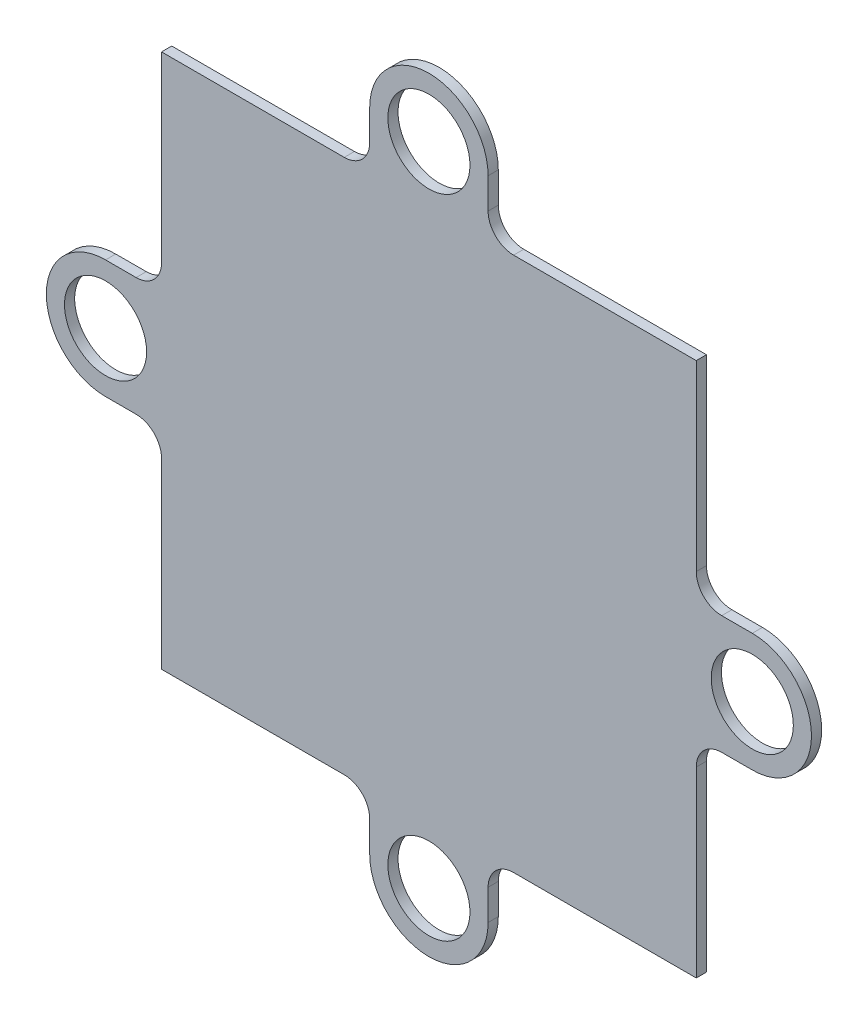
ISO-10303-21;
HEADER;
FILE_DESCRIPTION(('STEP AP214'),'2;1');
FILE_NAME('part.step','',(''),(''),'','','');
FILE_SCHEMA(('AUTOMOTIVE_DESIGN { 1 0 10303 214 1 1 1 1 }'));
ENDSEC;
DATA;
#1=APPLICATION_CONTEXT('core data for automotive mechanical design processes');
#2=APPLICATION_PROTOCOL_DEFINITION('international standard','automotive_design',2000,#1);
#3=PRODUCT_CONTEXT('',#1,'mechanical');
#4=PRODUCT('Part','Part','',(#3));
#5=PRODUCT_RELATED_PRODUCT_CATEGORY('part','',(#4));
#6=PRODUCT_DEFINITION_FORMATION('','',#4);
#7=PRODUCT_DEFINITION_CONTEXT('part definition',#1,'design');
#8=PRODUCT_DEFINITION('design','',#6,#7);
#9=PRODUCT_DEFINITION_SHAPE('','',#8);
#10=(LENGTH_UNIT() NAMED_UNIT(*) SI_UNIT(.MILLI.,.METRE.));
#11=(NAMED_UNIT(*) PLANE_ANGLE_UNIT() SI_UNIT($,.RADIAN.));
#12=(NAMED_UNIT(*) SI_UNIT($,.STERADIAN.) SOLID_ANGLE_UNIT());
#13=UNCERTAINTY_MEASURE_WITH_UNIT(LENGTH_MEASURE(1.E-05),#10,'distance_accuracy_value','');
#14=(GEOMETRIC_REPRESENTATION_CONTEXT(3) GLOBAL_UNCERTAINTY_ASSIGNED_CONTEXT((#13)) GLOBAL_UNIT_ASSIGNED_CONTEXT((#10,
#11,#12)) REPRESENTATION_CONTEXT('',''));
#15=CARTESIAN_POINT('',(0.,0.,0.));
#16=DIRECTION('',(0.,0.,1.));
#17=DIRECTION('',(1.,0.,0.));
#18=AXIS2_PLACEMENT_3D('',#15,#16,#17);
#19=CARTESIAN_POINT('',(0.,-4.64999999999974,0.8));
#20=DIRECTION('',(0.,1.,0.));
#21=DIRECTION('',(0.,0.,1.));
#22=AXIS2_PLACEMENT_3D('',#19,#20,#21);
#23=PLANE('',#22);
#24=DIRECTION('',(1.,0.,0.));
#25=VECTOR('',#24,1.);
#26=CARTESIAN_POINT('',(0.,-4.64999999999974,0.));
#27=LINE('',#26,#25);
#28=CARTESIAN_POINT('',(-25.4000000000001,-4.64999999999974,0.));
#29=VERTEX_POINT('',#28);
#30=CARTESIAN_POINT('',(-23.0000000000001,-4.64999999999974,0.));
#31=VERTEX_POINT('',#30);
#32=EDGE_CURVE('E282',#29,#31,#27,.T.);
#33=ORIENTED_EDGE('',*,*,#32,.T.);
#34=DIRECTION('',(0.,0.,-1.));
#35=VECTOR('',#34,1.);
#36=CARTESIAN_POINT('',(-23.0000000000001,-4.64999999999974,0.8));
#37=LINE('',#36,#35);
#38=CARTESIAN_POINT('',(-23.0000000000001,-4.64999999999974,0.8));
#39=VERTEX_POINT('',#38);
#40=EDGE_CURVE('E11',#39,#31,#37,.T.);
#41=ORIENTED_EDGE('',*,*,#40,.F.);
#42=DIRECTION('',(1.,0.,0.));
#43=VECTOR('',#42,1.);
#44=CARTESIAN_POINT('',(0.,-4.64999999999974,0.8));
#45=LINE('',#44,#43);
#46=CARTESIAN_POINT('',(-25.4000000000001,-4.64999999999974,0.8));
#47=VERTEX_POINT('',#46);
#48=EDGE_CURVE('E488',#47,#39,#45,.T.);
#49=ORIENTED_EDGE('',*,*,#48,.F.);
#50=DIRECTION('',(0.,0.,-1.));
#51=VECTOR('',#50,1.);
#52=CARTESIAN_POINT('',(-25.4000000000001,-4.64999999999974,0.8));
#53=LINE('',#52,#51);
#54=EDGE_CURVE('E262',#47,#29,#53,.T.);
#55=ORIENTED_EDGE('',*,*,#54,.T.);
#56=EDGE_LOOP('',(#33,#41,#49,#55));
#57=FACE_BOUND('',#56,.T.);
#58=ADVANCED_FACE('F45',(#57),#23,.F.);
#59=CARTESIAN_POINT('',(-23.0000000000001,-6.64999999999976,0.8));
#60=DIRECTION('',(0.,0.,-1.));
#61=DIRECTION('',(-1.,0.,0.));
#62=AXIS2_PLACEMENT_3D('',#59,#60,#61);
#63=CYLINDRICAL_SURFACE('',#62,2.00000000000001);
#64=CARTESIAN_POINT('',(-23.0000000000001,-6.64999999999976,0.));
#65=DIRECTION('',(0.,0.,1.));
#66=DIRECTION('',(1.,0.,0.));
#67=AXIS2_PLACEMENT_3D('',#64,#65,#66);
#68=CIRCLE('',#67,2.00000000000001);
#69=CARTESIAN_POINT('',(-21.0000000000001,-6.6499999999998,0.));
#70=VERTEX_POINT('',#69);
#71=EDGE_CURVE('E286',#31,#70,#68,.F.);
#72=ORIENTED_EDGE('',*,*,#71,.T.);
#73=DIRECTION('',(0.,0.,-1.));
#74=VECTOR('',#73,1.);
#75=CARTESIAN_POINT('',(-21.0000000000001,-6.6499999999998,0.8));
#76=LINE('',#75,#74);
#77=CARTESIAN_POINT('',(-21.0000000000001,-6.6499999999998,0.8));
#78=VERTEX_POINT('',#77);
#79=EDGE_CURVE('E55',#78,#70,#76,.T.);
#80=ORIENTED_EDGE('',*,*,#79,.F.);
#81=CARTESIAN_POINT('',(-23.0000000000001,-6.64999999999976,0.8));
#82=DIRECTION('',(0.,0.,1.));
#83=DIRECTION('',(1.,0.,0.));
#84=AXIS2_PLACEMENT_3D('',#81,#82,#83);
#85=CIRCLE('',#84,2.00000000000001);
#86=EDGE_CURVE('E162',#39,#78,#85,.F.);
#87=ORIENTED_EDGE('',*,*,#86,.F.);
#88=ORIENTED_EDGE('',*,*,#40,.T.);
#89=EDGE_LOOP('',(#72,#80,#87,#88));
#90=FACE_BOUND('',#89,.T.);
#91=ADVANCED_FACE('F468',(#90),#63,.F.);
#92=CARTESIAN_POINT('',(-21.0000000000001,-1.01544788837666E-13,0.8));
#93=DIRECTION('',(-1.,0.,0.));
#94=DIRECTION('',(0.,-1.,0.));
#95=AXIS2_PLACEMENT_3D('',#92,#93,#94);
#96=PLANE('',#95);
#97=DIRECTION('',(0.,1.,0.));
#98=VECTOR('',#97,1.);
#99=CARTESIAN_POINT('',(-21.0000000000001,-1.01544788837666E-13,0.));
#100=LINE('',#99,#98);
#101=CARTESIAN_POINT('',(-21.,-21.,0.));
#102=VERTEX_POINT('',#101);
#103=EDGE_CURVE('E290',#102,#70,#100,.T.);
#104=ORIENTED_EDGE('',*,*,#103,.F.);
#105=DIRECTION('',(0.,0.,-1.));
#106=VECTOR('',#105,1.);
#107=CARTESIAN_POINT('',(-21.,-21.,0.8));
#108=LINE('',#107,#106);
#109=CARTESIAN_POINT('',(-21.,-21.,0.8));
#110=VERTEX_POINT('',#109);
#111=EDGE_CURVE('E459',#110,#102,#108,.T.);
#112=ORIENTED_EDGE('',*,*,#111,.F.);
#113=DIRECTION('',(0.,1.,0.));
#114=VECTOR('',#113,1.);
#115=CARTESIAN_POINT('',(-21.0000000000001,-1.01544788837666E-13,0.8));
#116=LINE('',#115,#114);
#117=EDGE_CURVE('E467',#110,#78,#116,.T.);
#118=ORIENTED_EDGE('',*,*,#117,.T.);
#119=ORIENTED_EDGE('',*,*,#79,.T.);
#120=EDGE_LOOP('',(#104,#112,#118,#119));
#121=FACE_BOUND('',#120,.T.);
#122=ADVANCED_FACE('F465',(#121),#96,.T.);
#123=CARTESIAN_POINT('',(1.827806199078E-13,-20.9999999999998,0.8));
#124=DIRECTION('',(0.,1.,0.));
#125=DIRECTION('',(-1.,0.,0.));
#126=AXIS2_PLACEMENT_3D('',#123,#124,#125);
#127=PLANE('',#126);
#128=DIRECTION('',(1.,0.,0.));
#129=VECTOR('',#128,1.);
#130=CARTESIAN_POINT('',(1.827806199078E-13,-20.9999999999998,0.));
#131=LINE('',#130,#129);
#132=CARTESIAN_POINT('',(-6.65000000000012,-20.9999999999999,0.));
#133=VERTEX_POINT('',#132);
#134=EDGE_CURVE('E294',#102,#133,#131,.T.);
#135=ORIENTED_EDGE('',*,*,#134,.T.);
#136=DIRECTION('',(0.,0.,-1.));
#137=VECTOR('',#136,1.);
#138=CARTESIAN_POINT('',(-6.65000000000012,-20.9999999999999,0.8));
#139=LINE('',#138,#137);
#140=CARTESIAN_POINT('',(-6.65000000000012,-20.9999999999999,0.8));
#141=VERTEX_POINT('',#140);
#142=EDGE_CURVE('E456',#141,#133,#139,.T.);
#143=ORIENTED_EDGE('',*,*,#142,.F.);
#144=DIRECTION('',(1.,0.,0.));
#145=VECTOR('',#144,1.);
#146=CARTESIAN_POINT('',(1.827806199078E-13,-20.9999999999998,0.8));
#147=LINE('',#146,#145);
#148=EDGE_CURVE('E480',#110,#141,#147,.T.);
#149=ORIENTED_EDGE('',*,*,#148,.F.);
#150=ORIENTED_EDGE('',*,*,#111,.T.);
#151=EDGE_LOOP('',(#135,#143,#149,#150));
#152=FACE_BOUND('',#151,.T.);
#153=ADVANCED_FACE('F477',(#152),#127,.F.);
#154=CARTESIAN_POINT('',(-6.65000000000008,-22.9999999999999,0.8));
#155=DIRECTION('',(0.,0.,-1.));
#156=DIRECTION('',(-1.,0.,0.));
#157=AXIS2_PLACEMENT_3D('',#154,#155,#156);
#158=CYLINDRICAL_SURFACE('',#157,2.);
#159=CARTESIAN_POINT('',(-6.65000000000008,-22.9999999999999,0.));
#160=DIRECTION('',(0.,0.,1.));
#161=DIRECTION('',(1.,0.,0.));
#162=AXIS2_PLACEMENT_3D('',#159,#160,#161);
#163=CIRCLE('',#162,2.);
#164=CARTESIAN_POINT('',(-4.65000000000009,-22.9999999999999,0.));
#165=VERTEX_POINT('',#164);
#166=EDGE_CURVE('E298',#165,#133,#163,.T.);
#167=ORIENTED_EDGE('',*,*,#166,.F.);
#168=DIRECTION('',(0.,0.,-1.));
#169=VECTOR('',#168,1.);
#170=CARTESIAN_POINT('',(-4.65000000000009,-22.9999999999999,0.8));
#171=LINE('',#170,#169);
#172=CARTESIAN_POINT('',(-4.65000000000009,-22.9999999999999,0.8));
#173=VERTEX_POINT('',#172);
#174=EDGE_CURVE('E453',#173,#165,#171,.T.);
#175=ORIENTED_EDGE('',*,*,#174,.F.);
#176=CARTESIAN_POINT('',(-6.65000000000008,-22.9999999999999,0.8));
#177=DIRECTION('',(0.,0.,1.));
#178=DIRECTION('',(1.,0.,0.));
#179=AXIS2_PLACEMENT_3D('',#176,#177,#178);
#180=CIRCLE('',#179,2.);
#181=EDGE_CURVE('E483',#173,#141,#180,.T.);
#182=ORIENTED_EDGE('',*,*,#181,.T.);
#183=ORIENTED_EDGE('',*,*,#142,.T.);
#184=EDGE_LOOP('',(#167,#175,#182,#183));
#185=FACE_BOUND('',#184,.T.);
#186=ADVANCED_FACE('F841',(#185),#158,.F.);
#187=CARTESIAN_POINT('',(-4.65000000000009,0.,0.8));
#188=DIRECTION('',(-1.,0.,0.));
#189=DIRECTION('',(0.,0.,1.));
#190=AXIS2_PLACEMENT_3D('',#187,#188,#189);
#191=PLANE('',#190);
#192=DIRECTION('',(0.,1.,0.));
#193=VECTOR('',#192,1.);
#194=CARTESIAN_POINT('',(-4.65000000000009,0.,0.));
#195=LINE('',#194,#193);
#196=CARTESIAN_POINT('',(-4.65000000000009,-25.4,0.));
#197=VERTEX_POINT('',#196);
#198=EDGE_CURVE('E302',#197,#165,#195,.T.);
#199=ORIENTED_EDGE('',*,*,#198,.F.);
#200=DIRECTION('',(0.,0.,-1.));
#201=VECTOR('',#200,1.);
#202=CARTESIAN_POINT('',(-4.65000000000009,-25.4,0.8));
#203=LINE('',#202,#201);
#204=CARTESIAN_POINT('',(-4.65000000000009,-25.4,0.8));
#205=VERTEX_POINT('',#204);
#206=EDGE_CURVE('E450',#205,#197,#203,.T.);
#207=ORIENTED_EDGE('',*,*,#206,.F.);
#208=DIRECTION('',(0.,1.,0.));
#209=VECTOR('',#208,1.);
#210=CARTESIAN_POINT('',(-4.65000000000009,0.,0.8));
#211=LINE('',#210,#209);
#212=EDGE_CURVE('E494',#205,#173,#211,.T.);
#213=ORIENTED_EDGE('',*,*,#212,.T.);
#214=ORIENTED_EDGE('',*,*,#174,.T.);
#215=EDGE_LOOP('',(#199,#207,#213,#214));
#216=FACE_BOUND('',#215,.T.);
#217=ADVANCED_FACE('F832',(#216),#191,.T.);
#218=CARTESIAN_POINT('',(0.,-25.4,0.8));
#219=DIRECTION('',(0.,0.,-1.));
#220=DIRECTION('',(-1.,0.,0.));
#221=AXIS2_PLACEMENT_3D('',#218,#219,#220);
#222=CYLINDRICAL_SURFACE('',#221,4.65);
#223=CARTESIAN_POINT('',(0.,-25.4,0.));
#224=DIRECTION('',(0.,0.,1.));
#225=DIRECTION('',(1.,0.,0.));
#226=AXIS2_PLACEMENT_3D('',#223,#224,#225);
#227=CIRCLE('',#226,4.65);
#228=CARTESIAN_POINT('',(4.64999999999991,-25.4,0.));
#229=VERTEX_POINT('',#228);
#230=EDGE_CURVE('E306',#197,#229,#227,.T.);
#231=ORIENTED_EDGE('',*,*,#230,.T.);
#232=DIRECTION('',(0.,0.,-1.));
#233=VECTOR('',#232,1.);
#234=CARTESIAN_POINT('',(4.64999999999991,-25.4,0.8));
#235=LINE('',#234,#233);
#236=CARTESIAN_POINT('',(4.64999999999991,-25.4,0.8));
#237=VERTEX_POINT('',#236);
#238=EDGE_CURVE('E446',#237,#229,#235,.T.);
#239=ORIENTED_EDGE('',*,*,#238,.F.);
#240=CARTESIAN_POINT('',(0.,-25.4,0.8));
#241=DIRECTION('',(0.,0.,1.));
#242=DIRECTION('',(1.,0.,0.));
#243=AXIS2_PLACEMENT_3D('',#240,#241,#242);
#244=CIRCLE('',#243,4.65);
#245=EDGE_CURVE('E498',#205,#237,#244,.T.);
#246=ORIENTED_EDGE('',*,*,#245,.F.);
#247=ORIENTED_EDGE('',*,*,#206,.T.);
#248=EDGE_LOOP('',(#231,#239,#246,#247));
#249=FACE_BOUND('',#248,.T.);
#250=ADVANCED_FACE('F823',(#249),#222,.T.);
#251=CARTESIAN_POINT('',(4.64999999999991,0.,0.8));
#252=DIRECTION('',(-1.,0.,0.));
#253=DIRECTION('',(0.,0.,1.));
#254=AXIS2_PLACEMENT_3D('',#251,#252,#253);
#255=PLANE('',#254);
#256=DIRECTION('',(0.,1.,0.));
#257=VECTOR('',#256,1.);
#258=CARTESIAN_POINT('',(4.64999999999991,0.,0.));
#259=LINE('',#258,#257);
#260=CARTESIAN_POINT('',(4.64999999999991,-22.9999999999999,0.));
#261=VERTEX_POINT('',#260);
#262=EDGE_CURVE('E309',#229,#261,#259,.T.);
#263=ORIENTED_EDGE('',*,*,#262,.T.);
#264=DIRECTION('',(0.,0.,-1.));
#265=VECTOR('',#264,1.);
#266=CARTESIAN_POINT('',(4.64999999999991,-22.9999999999999,0.8));
#267=LINE('',#266,#265);
#268=CARTESIAN_POINT('',(4.64999999999991,-22.9999999999999,0.8));
#269=VERTEX_POINT('',#268);
#270=EDGE_CURVE('E442',#269,#261,#267,.T.);
#271=ORIENTED_EDGE('',*,*,#270,.F.);
#272=DIRECTION('',(0.,1.,0.));
#273=VECTOR('',#272,1.);
#274=CARTESIAN_POINT('',(4.64999999999991,0.,0.8));
#275=LINE('',#274,#273);
#276=EDGE_CURVE('E501',#237,#269,#275,.T.);
#277=ORIENTED_EDGE('',*,*,#276,.F.);
#278=ORIENTED_EDGE('',*,*,#238,.T.);
#279=EDGE_LOOP('',(#263,#271,#277,#278));
#280=FACE_BOUND('',#279,.T.);
#281=ADVANCED_FACE('F814',(#280),#255,.F.);
#282=CARTESIAN_POINT('',(6.6499999999999,-22.9999999999999,0.8));
#283=DIRECTION('',(0.,0.,-1.));
#284=DIRECTION('',(-1.,0.,0.));
#285=AXIS2_PLACEMENT_3D('',#282,#283,#284);
#286=CYLINDRICAL_SURFACE('',#285,2.);
#287=CARTESIAN_POINT('',(6.6499999999999,-22.9999999999999,0.));
#288=DIRECTION('',(0.,0.,1.));
#289=DIRECTION('',(1.,0.,0.));
#290=AXIS2_PLACEMENT_3D('',#287,#288,#289);
#291=CIRCLE('',#290,2.);
#292=CARTESIAN_POINT('',(6.64999999999994,-20.9999999999999,0.));
#293=VERTEX_POINT('',#292);
#294=EDGE_CURVE('E312',#261,#293,#291,.F.);
#295=ORIENTED_EDGE('',*,*,#294,.T.);
#296=DIRECTION('',(0.,0.,-1.));
#297=VECTOR('',#296,1.);
#298=CARTESIAN_POINT('',(6.64999999999994,-20.9999999999999,0.8));
#299=LINE('',#298,#297);
#300=CARTESIAN_POINT('',(6.64999999999994,-20.9999999999999,0.8));
#301=VERTEX_POINT('',#300);
#302=EDGE_CURVE('E438',#301,#293,#299,.T.);
#303=ORIENTED_EDGE('',*,*,#302,.F.);
#304=CARTESIAN_POINT('',(6.6499999999999,-22.9999999999999,0.8));
#305=DIRECTION('',(0.,0.,1.));
#306=DIRECTION('',(1.,0.,0.));
#307=AXIS2_PLACEMENT_3D('',#304,#305,#306);
#308=CIRCLE('',#307,2.);
#309=EDGE_CURVE('E504',#269,#301,#308,.F.);
#310=ORIENTED_EDGE('',*,*,#309,.F.);
#311=ORIENTED_EDGE('',*,*,#270,.T.);
#312=EDGE_LOOP('',(#295,#303,#310,#311));
#313=FACE_BOUND('',#312,.T.);
#314=ADVANCED_FACE('F805',(#313),#286,.F.);
#315=CARTESIAN_POINT('',(0.,-20.9999999999999,0.8));
#316=DIRECTION('',(0.,1.,0.));
#317=DIRECTION('',(0.,0.,1.));
#318=AXIS2_PLACEMENT_3D('',#315,#316,#317);
#319=PLANE('',#318);
#320=DIRECTION('',(1.,0.,0.));
#321=VECTOR('',#320,1.);
#322=CARTESIAN_POINT('',(0.,-20.9999999999999,0.));
#323=LINE('',#322,#321);
#324=CARTESIAN_POINT('',(21.,-21.,0.));
#325=VERTEX_POINT('',#324);
#326=EDGE_CURVE('E315',#293,#325,#323,.T.);
#327=ORIENTED_EDGE('',*,*,#326,.T.);
#328=DIRECTION('',(0.,0.,-1.));
#329=VECTOR('',#328,1.);
#330=CARTESIAN_POINT('',(21.,-21.,0.8));
#331=LINE('',#330,#329);
#332=CARTESIAN_POINT('',(21.,-21.,0.8));
#333=VERTEX_POINT('',#332);
#334=EDGE_CURVE('E434',#333,#325,#331,.T.);
#335=ORIENTED_EDGE('',*,*,#334,.F.);
#336=DIRECTION('',(1.,0.,0.));
#337=VECTOR('',#336,1.);
#338=CARTESIAN_POINT('',(0.,-20.9999999999999,0.8));
#339=LINE('',#338,#337);
#340=EDGE_CURVE('E507',#301,#333,#339,.T.);
#341=ORIENTED_EDGE('',*,*,#340,.F.);
#342=ORIENTED_EDGE('',*,*,#302,.T.);
#343=EDGE_LOOP('',(#327,#335,#341,#342));
#344=FACE_BOUND('',#343,.T.);
#345=ADVANCED_FACE('F796',(#344),#319,.F.);
#346=CARTESIAN_POINT('',(21.,0.,0.8));
#347=DIRECTION('',(-1.,0.,0.));
#348=DIRECTION('',(0.,-1.,0.));
#349=AXIS2_PLACEMENT_3D('',#346,#347,#348);
#350=PLANE('',#349);
#351=DIRECTION('',(0.,1.,0.));
#352=VECTOR('',#351,1.);
#353=CARTESIAN_POINT('',(21.,0.,0.));
#354=LINE('',#353,#352);
#355=CARTESIAN_POINT('',(21.,-6.6500000000001,0.));
#356=VERTEX_POINT('',#355);
#357=EDGE_CURVE('E318',#325,#356,#354,.T.);
#358=ORIENTED_EDGE('',*,*,#357,.T.);
#359=DIRECTION('',(0.,0.,-1.));
#360=VECTOR('',#359,1.);
#361=CARTESIAN_POINT('',(21.,-6.6500000000001,0.8));
#362=LINE('',#361,#360);
#363=CARTESIAN_POINT('',(21.,-6.6500000000001,0.8));
#364=VERTEX_POINT('',#363);
#365=EDGE_CURVE('E431',#364,#356,#362,.T.);
#366=ORIENTED_EDGE('',*,*,#365,.F.);
#367=DIRECTION('',(0.,1.,0.));
#368=VECTOR('',#367,1.);
#369=CARTESIAN_POINT('',(21.,0.,0.8));
#370=LINE('',#369,#368);
#371=EDGE_CURVE('E510',#333,#364,#370,.T.);
#372=ORIENTED_EDGE('',*,*,#371,.F.);
#373=ORIENTED_EDGE('',*,*,#334,.T.);
#374=EDGE_LOOP('',(#358,#366,#372,#373));
#375=FACE_BOUND('',#374,.T.);
#376=ADVANCED_FACE('F787',(#375),#350,.F.);
#377=CARTESIAN_POINT('',(23.,-6.65000000000009,0.8));
#378=DIRECTION('',(0.,0.,-1.));
#379=DIRECTION('',(-1.,0.,0.));
#380=AXIS2_PLACEMENT_3D('',#377,#378,#379);
#381=CYLINDRICAL_SURFACE('',#380,2.);
#382=CARTESIAN_POINT('',(23.,-6.65000000000009,0.));
#383=DIRECTION('',(0.,0.,1.));
#384=DIRECTION('',(1.,0.,0.));
#385=AXIS2_PLACEMENT_3D('',#382,#383,#384);
#386=CIRCLE('',#385,2.);
#387=CARTESIAN_POINT('',(23.,-4.6500000000001,0.));
#388=VERTEX_POINT('',#387);
#389=EDGE_CURVE('E322',#388,#356,#386,.T.);
#390=ORIENTED_EDGE('',*,*,#389,.F.);
#391=DIRECTION('',(0.,0.,-1.));
#392=VECTOR('',#391,1.);
#393=CARTESIAN_POINT('',(23.,-4.6500000000001,0.8));
#394=LINE('',#393,#392);
#395=CARTESIAN_POINT('',(23.,-4.6500000000001,0.8));
#396=VERTEX_POINT('',#395);
#397=EDGE_CURVE('E428',#396,#388,#394,.T.);
#398=ORIENTED_EDGE('',*,*,#397,.F.);
#399=CARTESIAN_POINT('',(23.,-6.65000000000009,0.8));
#400=DIRECTION('',(0.,0.,1.));
#401=DIRECTION('',(1.,0.,0.));
#402=AXIS2_PLACEMENT_3D('',#399,#400,#401);
#403=CIRCLE('',#402,2.);
#404=EDGE_CURVE('E513',#396,#364,#403,.T.);
#405=ORIENTED_EDGE('',*,*,#404,.T.);
#406=ORIENTED_EDGE('',*,*,#365,.T.);
#407=EDGE_LOOP('',(#390,#398,#405,#406));
#408=FACE_BOUND('',#407,.T.);
#409=ADVANCED_FACE('F778',(#408),#381,.F.);
#410=CARTESIAN_POINT('',(0.,-4.6500000000001,0.8));
#411=DIRECTION('',(0.,-1.,0.));
#412=DIRECTION('',(0.,0.,-1.));
#413=AXIS2_PLACEMENT_3D('',#410,#411,#412);
#414=PLANE('',#413);
#415=DIRECTION('',(-1.,0.,0.));
#416=VECTOR('',#415,1.);
#417=CARTESIAN_POINT('',(0.,-4.6500000000001,0.));
#418=LINE('',#417,#416);
#419=CARTESIAN_POINT('',(25.4000000000001,-4.6500000000001,0.));
#420=VERTEX_POINT('',#419);
#421=EDGE_CURVE('E326',#420,#388,#418,.T.);
#422=ORIENTED_EDGE('',*,*,#421,.F.);
#423=DIRECTION('',(0.,0.,-1.));
#424=VECTOR('',#423,1.);
#425=CARTESIAN_POINT('',(25.4000000000001,-4.6500000000001,0.8));
#426=LINE('',#425,#424);
#427=CARTESIAN_POINT('',(25.4000000000001,-4.6500000000001,0.8));
#428=VERTEX_POINT('',#427);
#429=EDGE_CURVE('E425',#428,#420,#426,.T.);
#430=ORIENTED_EDGE('',*,*,#429,.F.);
#431=DIRECTION('',(-1.,0.,0.));
#432=VECTOR('',#431,1.);
#433=CARTESIAN_POINT('',(0.,-4.6500000000001,0.8));
#434=LINE('',#433,#432);
#435=EDGE_CURVE('E517',#428,#396,#434,.T.);
#436=ORIENTED_EDGE('',*,*,#435,.T.);
#437=ORIENTED_EDGE('',*,*,#397,.T.);
#438=EDGE_LOOP('',(#422,#430,#436,#437));
#439=FACE_BOUND('',#438,.T.);
#440=ADVANCED_FACE('F769',(#439),#414,.T.);
#441=CARTESIAN_POINT('',(25.4000000000001,0.,0.8));
#442=DIRECTION('',(0.,0.,-1.));
#443=DIRECTION('',(-1.,0.,0.));
#444=AXIS2_PLACEMENT_3D('',#441,#442,#443);
#445=CYLINDRICAL_SURFACE('',#444,4.65);
#446=CARTESIAN_POINT('',(25.4000000000001,0.,0.));
#447=DIRECTION('',(0.,0.,1.));
#448=DIRECTION('',(1.,0.,0.));
#449=AXIS2_PLACEMENT_3D('',#446,#447,#448);
#450=CIRCLE('',#449,4.65);
#451=CARTESIAN_POINT('',(25.4000000000001,4.6499999999999,0.));
#452=VERTEX_POINT('',#451);
#453=EDGE_CURVE('E330',#420,#452,#450,.T.);
#454=ORIENTED_EDGE('',*,*,#453,.T.);
#455=DIRECTION('',(0.,0.,-1.));
#456=VECTOR('',#455,1.);
#457=CARTESIAN_POINT('',(25.4000000000001,4.6499999999999,0.8));
#458=LINE('',#457,#456);
#459=CARTESIAN_POINT('',(25.4000000000001,4.6499999999999,0.8));
#460=VERTEX_POINT('',#459);
#461=EDGE_CURVE('E421',#460,#452,#458,.T.);
#462=ORIENTED_EDGE('',*,*,#461,.F.);
#463=CARTESIAN_POINT('',(25.4000000000001,0.,0.8));
#464=DIRECTION('',(0.,0.,1.));
#465=DIRECTION('',(1.,0.,0.));
#466=AXIS2_PLACEMENT_3D('',#463,#464,#465);
#467=CIRCLE('',#466,4.65);
#468=EDGE_CURVE('E521',#428,#460,#467,.T.);
#469=ORIENTED_EDGE('',*,*,#468,.F.);
#470=ORIENTED_EDGE('',*,*,#429,.T.);
#471=EDGE_LOOP('',(#454,#462,#469,#470));
#472=FACE_BOUND('',#471,.T.);
#473=ADVANCED_FACE('F760',(#472),#445,.T.);
#474=CARTESIAN_POINT('',(0.,4.6499999999999,0.8));
#475=DIRECTION('',(0.,-1.,0.));
#476=DIRECTION('',(0.,0.,-1.));
#477=AXIS2_PLACEMENT_3D('',#474,#475,#476);
#478=PLANE('',#477);
#479=DIRECTION('',(-1.,0.,0.));
#480=VECTOR('',#479,1.);
#481=CARTESIAN_POINT('',(0.,4.6499999999999,0.));
#482=LINE('',#481,#480);
#483=CARTESIAN_POINT('',(23.,4.6499999999999,0.));
#484=VERTEX_POINT('',#483);
#485=EDGE_CURVE('E333',#452,#484,#482,.T.);
#486=ORIENTED_EDGE('',*,*,#485,.T.);
#487=DIRECTION('',(0.,0.,-1.));
#488=VECTOR('',#487,1.);
#489=CARTESIAN_POINT('',(23.,4.6499999999999,0.8));
#490=LINE('',#489,#488);
#491=CARTESIAN_POINT('',(23.,4.6499999999999,0.8));
#492=VERTEX_POINT('',#491);
#493=EDGE_CURVE('E417',#492,#484,#490,.T.);
#494=ORIENTED_EDGE('',*,*,#493,.F.);
#495=DIRECTION('',(-1.,0.,0.));
#496=VECTOR('',#495,1.);
#497=CARTESIAN_POINT('',(0.,4.6499999999999,0.8));
#498=LINE('',#497,#496);
#499=EDGE_CURVE('E524',#460,#492,#498,.T.);
#500=ORIENTED_EDGE('',*,*,#499,.F.);
#501=ORIENTED_EDGE('',*,*,#461,.T.);
#502=EDGE_LOOP('',(#486,#494,#500,#501));
#503=FACE_BOUND('',#502,.T.);
#504=ADVANCED_FACE('F751',(#503),#478,.F.);
#505=CARTESIAN_POINT('',(23.,6.64999999999991,0.8));
#506=DIRECTION('',(0.,0.,-1.));
#507=DIRECTION('',(-1.,0.,0.));
#508=AXIS2_PLACEMENT_3D('',#505,#506,#507);
#509=CYLINDRICAL_SURFACE('',#508,2.00000000000001);
#510=CARTESIAN_POINT('',(23.,6.64999999999991,0.));
#511=DIRECTION('',(0.,0.,1.));
#512=DIRECTION('',(1.,0.,0.));
#513=AXIS2_PLACEMENT_3D('',#510,#511,#512);
#514=CIRCLE('',#513,2.00000000000001);
#515=CARTESIAN_POINT('',(21.,6.64999999999993,0.));
#516=VERTEX_POINT('',#515);
#517=EDGE_CURVE('E336',#484,#516,#514,.F.);
#518=ORIENTED_EDGE('',*,*,#517,.T.);
#519=DIRECTION('',(0.,0.,-1.));
#520=VECTOR('',#519,1.);
#521=CARTESIAN_POINT('',(21.,6.64999999999993,0.8));
#522=LINE('',#521,#520);
#523=CARTESIAN_POINT('',(21.,6.64999999999993,0.8));
#524=VERTEX_POINT('',#523);
#525=EDGE_CURVE('E413',#524,#516,#522,.T.);
#526=ORIENTED_EDGE('',*,*,#525,.F.);
#527=CARTESIAN_POINT('',(23.,6.64999999999991,0.8));
#528=DIRECTION('',(0.,0.,1.));
#529=DIRECTION('',(1.,0.,0.));
#530=AXIS2_PLACEMENT_3D('',#527,#528,#529);
#531=CIRCLE('',#530,2.00000000000001);
#532=EDGE_CURVE('E527',#492,#524,#531,.F.);
#533=ORIENTED_EDGE('',*,*,#532,.F.);
#534=ORIENTED_EDGE('',*,*,#493,.T.);
#535=EDGE_LOOP('',(#518,#526,#533,#534));
#536=FACE_BOUND('',#535,.T.);
#537=ADVANCED_FACE('F742',(#536),#509,.F.);
#538=CARTESIAN_POINT('',(21.,0.,0.8));
#539=DIRECTION('',(-1.,0.,0.));
#540=DIRECTION('',(0.,0.,1.));
#541=AXIS2_PLACEMENT_3D('',#538,#539,#540);
#542=PLANE('',#541);
#543=DIRECTION('',(0.,1.,0.));
#544=VECTOR('',#543,1.);
#545=CARTESIAN_POINT('',(21.,0.,0.));
#546=LINE('',#545,#544);
#547=CARTESIAN_POINT('',(21.,21.,0.));
#548=VERTEX_POINT('',#547);
#549=EDGE_CURVE('E339',#516,#548,#546,.T.);
#550=ORIENTED_EDGE('',*,*,#549,.T.);
#551=DIRECTION('',(0.,0.,-1.));
#552=VECTOR('',#551,1.);
#553=CARTESIAN_POINT('',(21.,21.,0.8));
#554=LINE('',#553,#552);
#555=CARTESIAN_POINT('',(21.,21.,0.8));
#556=VERTEX_POINT('',#555);
#557=EDGE_CURVE('E410',#556,#548,#554,.T.);
#558=ORIENTED_EDGE('',*,*,#557,.F.);
#559=DIRECTION('',(0.,1.,0.));
#560=VECTOR('',#559,1.);
#561=CARTESIAN_POINT('',(21.,0.,0.8));
#562=LINE('',#561,#560);
#563=EDGE_CURVE('E530',#524,#556,#562,.T.);
#564=ORIENTED_EDGE('',*,*,#563,.F.);
#565=ORIENTED_EDGE('',*,*,#525,.T.);
#566=EDGE_LOOP('',(#550,#558,#564,#565));
#567=FACE_BOUND('',#566,.T.);
#568=ADVANCED_FACE('F733',(#567),#542,.F.);
#569=CARTESIAN_POINT('',(0.,21.,0.8));
#570=DIRECTION('',(0.,1.,0.));
#571=DIRECTION('',(0.,0.,1.));
#572=AXIS2_PLACEMENT_3D('',#569,#570,#571);
#573=PLANE('',#572);
#574=DIRECTION('',(1.,0.,0.));
#575=VECTOR('',#574,1.);
#576=CARTESIAN_POINT('',(0.,21.,0.));
#577=LINE('',#576,#575);
#578=CARTESIAN_POINT('',(6.65000000000001,21.,0.));
#579=VERTEX_POINT('',#578);
#580=EDGE_CURVE('E343',#579,#548,#577,.T.);
#581=ORIENTED_EDGE('',*,*,#580,.F.);
#582=DIRECTION('',(0.,0.,-1.));
#583=VECTOR('',#582,1.);
#584=CARTESIAN_POINT('',(6.65000000000001,21.,0.8));
#585=LINE('',#584,#583);
#586=CARTESIAN_POINT('',(6.65000000000001,21.,0.8));
#587=VERTEX_POINT('',#586);
#588=EDGE_CURVE('E407',#587,#579,#585,.T.);
#589=ORIENTED_EDGE('',*,*,#588,.F.);
#590=DIRECTION('',(1.,0.,0.));
#591=VECTOR('',#590,1.);
#592=CARTESIAN_POINT('',(0.,21.,0.8));
#593=LINE('',#592,#591);
#594=EDGE_CURVE('E533',#587,#556,#593,.T.);
#595=ORIENTED_EDGE('',*,*,#594,.T.);
#596=ORIENTED_EDGE('',*,*,#557,.T.);
#597=EDGE_LOOP('',(#581,#589,#595,#596));
#598=FACE_BOUND('',#597,.T.);
#599=ADVANCED_FACE('F724',(#598),#573,.T.);
#600=CARTESIAN_POINT('',(6.65000000000001,23.,0.8));
#601=DIRECTION('',(0.,0.,-1.));
#602=DIRECTION('',(-1.,0.,0.));
#603=AXIS2_PLACEMENT_3D('',#600,#601,#602);
#604=CYLINDRICAL_SURFACE('',#603,2.);
#605=CARTESIAN_POINT('',(6.65000000000001,23.,0.));
#606=DIRECTION('',(0.,0.,1.));
#607=DIRECTION('',(1.,0.,0.));
#608=AXIS2_PLACEMENT_3D('',#605,#606,#607);
#609=CIRCLE('',#608,2.);
#610=CARTESIAN_POINT('',(4.65,23.,0.));
#611=VERTEX_POINT('',#610);
#612=EDGE_CURVE('E347',#611,#579,#609,.T.);
#613=ORIENTED_EDGE('',*,*,#612,.F.);
#614=DIRECTION('',(0.,0.,-1.));
#615=VECTOR('',#614,1.);
#616=CARTESIAN_POINT('',(4.65,23.,0.8));
#617=LINE('',#616,#615);
#618=CARTESIAN_POINT('',(4.65,23.,0.8));
#619=VERTEX_POINT('',#618);
#620=EDGE_CURVE('E404',#619,#611,#617,.T.);
#621=ORIENTED_EDGE('',*,*,#620,.F.);
#622=CARTESIAN_POINT('',(6.65000000000001,23.,0.8));
#623=DIRECTION('',(0.,0.,1.));
#624=DIRECTION('',(1.,0.,0.));
#625=AXIS2_PLACEMENT_3D('',#622,#623,#624);
#626=CIRCLE('',#625,2.);
#627=EDGE_CURVE('E537',#619,#587,#626,.T.);
#628=ORIENTED_EDGE('',*,*,#627,.T.);
#629=ORIENTED_EDGE('',*,*,#588,.T.);
#630=EDGE_LOOP('',(#613,#621,#628,#629));
#631=FACE_BOUND('',#630,.T.);
#632=ADVANCED_FACE('F715',(#631),#604,.F.);
#633=CARTESIAN_POINT('',(4.65,0.,0.8));
#634=DIRECTION('',(1.,0.,0.));
#635=DIRECTION('',(0.,0.,-1.));
#636=AXIS2_PLACEMENT_3D('',#633,#634,#635);
#637=PLANE('',#636);
#638=DIRECTION('',(0.,-1.,0.));
#639=VECTOR('',#638,1.);
#640=CARTESIAN_POINT('',(4.65,0.,0.));
#641=LINE('',#640,#639);
#642=CARTESIAN_POINT('',(4.65,25.4000000000001,0.));
#643=VERTEX_POINT('',#642);
#644=EDGE_CURVE('E351',#643,#611,#641,.T.);
#645=ORIENTED_EDGE('',*,*,#644,.F.);
#646=DIRECTION('',(0.,0.,-1.));
#647=VECTOR('',#646,1.);
#648=CARTESIAN_POINT('',(4.65,25.4000000000001,0.8));
#649=LINE('',#648,#647);
#650=CARTESIAN_POINT('',(4.65,25.4000000000001,0.8));
#651=VERTEX_POINT('',#650);
#652=EDGE_CURVE('E401',#651,#643,#649,.T.);
#653=ORIENTED_EDGE('',*,*,#652,.F.);
#654=DIRECTION('',(0.,-1.,0.));
#655=VECTOR('',#654,1.);
#656=CARTESIAN_POINT('',(4.65,0.,0.8));
#657=LINE('',#656,#655);
#658=EDGE_CURVE('E541',#651,#619,#657,.T.);
#659=ORIENTED_EDGE('',*,*,#658,.T.);
#660=ORIENTED_EDGE('',*,*,#620,.T.);
#661=EDGE_LOOP('',(#645,#653,#659,#660));
#662=FACE_BOUND('',#661,.T.);
#663=ADVANCED_FACE('F706',(#662),#637,.T.);
#664=CARTESIAN_POINT('',(0.,25.4000000000001,0.8));
#665=DIRECTION('',(0.,0.,-1.));
#666=DIRECTION('',(-1.,0.,0.));
#667=AXIS2_PLACEMENT_3D('',#664,#665,#666);
#668=CYLINDRICAL_SURFACE('',#667,4.65);
#669=CARTESIAN_POINT('',(0.,25.4000000000001,0.));
#670=DIRECTION('',(0.,0.,1.));
#671=DIRECTION('',(1.,0.,0.));
#672=AXIS2_PLACEMENT_3D('',#669,#670,#671);
#673=CIRCLE('',#672,4.65);
#674=CARTESIAN_POINT('',(-4.65,25.4000000000001,0.));
#675=VERTEX_POINT('',#674);
#676=EDGE_CURVE('E355',#643,#675,#673,.T.);
#677=ORIENTED_EDGE('',*,*,#676,.T.);
#678=DIRECTION('',(0.,0.,-1.));
#679=VECTOR('',#678,1.);
#680=CARTESIAN_POINT('',(-4.65,25.4000000000001,0.8));
#681=LINE('',#680,#679);
#682=CARTESIAN_POINT('',(-4.65,25.4000000000001,0.8));
#683=VERTEX_POINT('',#682);
#684=EDGE_CURVE('E397',#683,#675,#681,.T.);
#685=ORIENTED_EDGE('',*,*,#684,.F.);
#686=CARTESIAN_POINT('',(0.,25.4000000000001,0.8));
#687=DIRECTION('',(0.,0.,1.));
#688=DIRECTION('',(1.,0.,0.));
#689=AXIS2_PLACEMENT_3D('',#686,#687,#688);
#690=CIRCLE('',#689,4.65);
#691=EDGE_CURVE('E545',#651,#683,#690,.T.);
#692=ORIENTED_EDGE('',*,*,#691,.F.);
#693=ORIENTED_EDGE('',*,*,#652,.T.);
#694=EDGE_LOOP('',(#677,#685,#692,#693));
#695=FACE_BOUND('',#694,.T.);
#696=ADVANCED_FACE('F697',(#695),#668,.T.);
#697=CARTESIAN_POINT('',(-4.65,0.,0.8));
#698=DIRECTION('',(1.,0.,0.));
#699=DIRECTION('',(0.,0.,-1.));
#700=AXIS2_PLACEMENT_3D('',#697,#698,#699);
#701=PLANE('',#700);
#702=DIRECTION('',(0.,-1.,0.));
#703=VECTOR('',#702,1.);
#704=CARTESIAN_POINT('',(-4.65,0.,0.));
#705=LINE('',#704,#703);
#706=CARTESIAN_POINT('',(-4.65,23.,0.));
#707=VERTEX_POINT('',#706);
#708=EDGE_CURVE('E358',#675,#707,#705,.T.);
#709=ORIENTED_EDGE('',*,*,#708,.T.);
#710=DIRECTION('',(0.,0.,-1.));
#711=VECTOR('',#710,1.);
#712=CARTESIAN_POINT('',(-4.65,23.,0.8));
#713=LINE('',#712,#711);
#714=CARTESIAN_POINT('',(-4.65,23.,0.8));
#715=VERTEX_POINT('',#714);
#716=EDGE_CURVE('E393',#715,#707,#713,.T.);
#717=ORIENTED_EDGE('',*,*,#716,.F.);
#718=DIRECTION('',(0.,-1.,0.));
#719=VECTOR('',#718,1.);
#720=CARTESIAN_POINT('',(-4.65,0.,0.8));
#721=LINE('',#720,#719);
#722=EDGE_CURVE('E548',#683,#715,#721,.T.);
#723=ORIENTED_EDGE('',*,*,#722,.F.);
#724=ORIENTED_EDGE('',*,*,#684,.T.);
#725=EDGE_LOOP('',(#709,#717,#723,#724));
#726=FACE_BOUND('',#725,.T.);
#727=ADVANCED_FACE('F688',(#726),#701,.F.);
#728=CARTESIAN_POINT('',(-6.65,23.,0.8));
#729=DIRECTION('',(0.,0.,-1.));
#730=DIRECTION('',(-1.,0.,0.));
#731=AXIS2_PLACEMENT_3D('',#728,#729,#730);
#732=CYLINDRICAL_SURFACE('',#731,2.);
#733=CARTESIAN_POINT('',(-6.65,23.,0.));
#734=DIRECTION('',(0.,0.,1.));
#735=DIRECTION('',(1.,0.,0.));
#736=AXIS2_PLACEMENT_3D('',#733,#734,#735);
#737=CIRCLE('',#736,2.);
#738=CARTESIAN_POINT('',(-6.65,21.,0.));
#739=VERTEX_POINT('',#738);
#740=EDGE_CURVE('E361',#707,#739,#737,.F.);
#741=ORIENTED_EDGE('',*,*,#740,.T.);
#742=DIRECTION('',(0.,0.,-1.));
#743=VECTOR('',#742,1.);
#744=CARTESIAN_POINT('',(-6.65,21.,0.8));
#745=LINE('',#744,#743);
#746=CARTESIAN_POINT('',(-6.65,21.,0.8));
#747=VERTEX_POINT('',#746);
#748=EDGE_CURVE('E390',#747,#739,#745,.T.);
#749=ORIENTED_EDGE('',*,*,#748,.F.);
#750=CARTESIAN_POINT('',(-6.65,23.,0.8));
#751=DIRECTION('',(0.,0.,1.));
#752=DIRECTION('',(1.,0.,0.));
#753=AXIS2_PLACEMENT_3D('',#750,#751,#752);
#754=CIRCLE('',#753,2.);
#755=EDGE_CURVE('E551',#715,#747,#754,.F.);
#756=ORIENTED_EDGE('',*,*,#755,.F.);
#757=ORIENTED_EDGE('',*,*,#716,.T.);
#758=EDGE_LOOP('',(#741,#749,#756,#757));
#759=FACE_BOUND('',#758,.T.);
#760=ADVANCED_FACE('F679',(#759),#732,.F.);
#761=CARTESIAN_POINT('',(0.,21.,0.8));
#762=DIRECTION('',(0.,1.,0.));
#763=DIRECTION('',(0.,0.,1.));
#764=AXIS2_PLACEMENT_3D('',#761,#762,#763);
#765=PLANE('',#764);
#766=DIRECTION('',(1.,0.,0.));
#767=VECTOR('',#766,1.);
#768=CARTESIAN_POINT('',(0.,21.,0.));
#769=LINE('',#768,#767);
#770=CARTESIAN_POINT('',(-21.,21.,0.));
#771=VERTEX_POINT('',#770);
#772=EDGE_CURVE('E365',#771,#739,#769,.T.);
#773=ORIENTED_EDGE('',*,*,#772,.F.);
#774=DIRECTION('',(0.,0.,-1.));
#775=VECTOR('',#774,1.);
#776=CARTESIAN_POINT('',(-21.,21.,0.8));
#777=LINE('',#776,#775);
#778=CARTESIAN_POINT('',(-21.,21.,0.8));
#779=VERTEX_POINT('',#778);
#780=EDGE_CURVE('E387',#779,#771,#777,.T.);
#781=ORIENTED_EDGE('',*,*,#780,.F.);
#782=DIRECTION('',(1.,0.,0.));
#783=VECTOR('',#782,1.);
#784=CARTESIAN_POINT('',(0.,21.,0.8));
#785=LINE('',#784,#783);
#786=EDGE_CURVE('E554',#779,#747,#785,.T.);
#787=ORIENTED_EDGE('',*,*,#786,.T.);
#788=ORIENTED_EDGE('',*,*,#748,.T.);
#789=EDGE_LOOP('',(#773,#781,#787,#788));
#790=FACE_BOUND('',#789,.T.);
#791=ADVANCED_FACE('F670',(#790),#765,.T.);
#792=CARTESIAN_POINT('',(-20.9999999999999,-1.01544788837668E-13,0.8));
#793=DIRECTION('',(-1.,0.,0.));
#794=DIRECTION('',(0.,-1.,0.));
#795=AXIS2_PLACEMENT_3D('',#792,#793,#794);
#796=PLANE('',#795);
#797=DIRECTION('',(0.,1.,0.));
#798=VECTOR('',#797,1.);
#799=CARTESIAN_POINT('',(-20.9999999999999,-1.01544788837668E-13,0.));
#800=LINE('',#799,#798);
#801=CARTESIAN_POINT('',(-20.9999999999999,6.65000000000023,0.));
#802=VERTEX_POINT('',#801);
#803=EDGE_CURVE('E369',#802,#771,#800,.T.);
#804=ORIENTED_EDGE('',*,*,#803,.F.);
#805=DIRECTION('',(0.,0.,-1.));
#806=VECTOR('',#805,1.);
#807=CARTESIAN_POINT('',(-20.9999999999999,6.65000000000023,0.8));
#808=LINE('',#807,#806);
#809=CARTESIAN_POINT('',(-20.9999999999999,6.65000000000023,0.8));
#810=VERTEX_POINT('',#809);
#811=EDGE_CURVE('E248',#810,#802,#808,.T.);
#812=ORIENTED_EDGE('',*,*,#811,.F.);
#813=DIRECTION('',(0.,1.,0.));
#814=VECTOR('',#813,1.);
#815=CARTESIAN_POINT('',(-20.9999999999999,-1.01544788837668E-13,0.8));
#816=LINE('',#815,#814);
#817=EDGE_CURVE('E255',#810,#779,#816,.T.);
#818=ORIENTED_EDGE('',*,*,#817,.T.);
#819=ORIENTED_EDGE('',*,*,#780,.T.);
#820=EDGE_LOOP('',(#804,#812,#818,#819));
#821=FACE_BOUND('',#820,.T.);
#822=ADVANCED_FACE('F560',(#821),#796,.T.);
#823=CARTESIAN_POINT('',(-22.9999999999999,6.65000000000024,0.8));
#824=DIRECTION('',(0.,0.,-1.));
#825=DIRECTION('',(-1.,0.,0.));
#826=AXIS2_PLACEMENT_3D('',#823,#824,#825);
#827=CYLINDRICAL_SURFACE('',#826,1.99999999999999);
#828=CARTESIAN_POINT('',(-22.9999999999999,6.65000000000024,0.));
#829=DIRECTION('',(0.,0.,1.));
#830=DIRECTION('',(1.,0.,0.));
#831=AXIS2_PLACEMENT_3D('',#828,#829,#830);
#832=CIRCLE('',#831,1.99999999999999);
#833=CARTESIAN_POINT('',(-22.9999999999999,4.65000000000026,0.));
#834=VERTEX_POINT('',#833);
#835=EDGE_CURVE('E242',#834,#802,#832,.T.);
#836=ORIENTED_EDGE('',*,*,#835,.F.);
#837=DIRECTION('',(0.,0.,-1.));
#838=VECTOR('',#837,1.);
#839=CARTESIAN_POINT('',(-22.9999999999999,4.65000000000026,0.8));
#840=LINE('',#839,#838);
#841=CARTESIAN_POINT('',(-22.9999999999999,4.65000000000026,0.8));
#842=VERTEX_POINT('',#841);
#843=EDGE_CURVE('E237',#842,#834,#840,.T.);
#844=ORIENTED_EDGE('',*,*,#843,.F.);
#845=CARTESIAN_POINT('',(-22.9999999999999,6.65000000000024,0.8));
#846=DIRECTION('',(0.,0.,1.));
#847=DIRECTION('',(1.,0.,0.));
#848=AXIS2_PLACEMENT_3D('',#845,#846,#847);
#849=CIRCLE('',#848,1.99999999999999);
#850=EDGE_CURVE('E240',#842,#810,#849,.T.);
#851=ORIENTED_EDGE('',*,*,#850,.T.);
#852=ORIENTED_EDGE('',*,*,#811,.T.);
#853=EDGE_LOOP('',(#836,#844,#851,#852));
#854=FACE_BOUND('',#853,.T.);
#855=ADVANCED_FACE('F239',(#854),#827,.F.);
#856=CARTESIAN_POINT('',(0.,4.65000000000026,0.8));
#857=DIRECTION('',(0.,1.,0.));
#858=DIRECTION('',(0.,0.,1.));
#859=AXIS2_PLACEMENT_3D('',#856,#857,#858);
#860=PLANE('',#859);
#861=DIRECTION('',(1.,0.,0.));
#862=VECTOR('',#861,1.);
#863=CARTESIAN_POINT('',(0.,4.65000000000026,0.));
#864=LINE('',#863,#862);
#865=CARTESIAN_POINT('',(-25.4000000000001,4.65000000000026,0.));
#866=VERTEX_POINT('',#865);
#867=EDGE_CURVE('E375',#866,#834,#864,.T.);
#868=ORIENTED_EDGE('',*,*,#867,.F.);
#869=DIRECTION('',(0.,0.,-1.));
#870=VECTOR('',#869,1.);
#871=CARTESIAN_POINT('',(-25.4000000000001,4.65000000000026,0.8));
#872=LINE('',#871,#870);
#873=CARTESIAN_POINT('',(-25.4000000000001,4.65000000000026,0.8));
#874=VERTEX_POINT('',#873);
#875=EDGE_CURVE('E151',#874,#866,#872,.T.);
#876=ORIENTED_EDGE('',*,*,#875,.F.);
#877=DIRECTION('',(1.,0.,0.));
#878=VECTOR('',#877,1.);
#879=CARTESIAN_POINT('',(0.,4.65000000000026,0.8));
#880=LINE('',#879,#878);
#881=EDGE_CURVE('E252',#874,#842,#880,.T.);
#882=ORIENTED_EDGE('',*,*,#881,.T.);
#883=ORIENTED_EDGE('',*,*,#843,.T.);
#884=EDGE_LOOP('',(#868,#876,#882,#883));
#885=FACE_BOUND('',#884,.T.);
#886=ADVANCED_FACE('F258',(#885),#860,.T.);
#887=CARTESIAN_POINT('',(-25.4000000000001,2.63677968348475E-13,0.8));
#888=DIRECTION('',(0.,0.,-1.));
#889=DIRECTION('',(-1.,0.,0.));
#890=AXIS2_PLACEMENT_3D('',#887,#888,#889);
#891=CYLINDRICAL_SURFACE('',#890,3.225);
#892=CARTESIAN_POINT('',(-25.4000000000001,2.63677968348475E-13,0.8));
#893=DIRECTION('',(0.,0.,1.));
#894=DIRECTION('',(1.,0.,0.));
#895=AXIS2_PLACEMENT_3D('',#892,#893,#894);
#896=CIRCLE('',#895,3.225);
#897=CARTESIAN_POINT('',(-22.1750000000001,2.63677968348475E-13,0.8));
#898=VERTEX_POINT('',#897);
#899=EDGE_CURVE('E977',#898,#898,#896,.T.);
#900=ORIENTED_EDGE('',*,*,#899,.T.);
#901=EDGE_LOOP('',(#900));
#902=FACE_BOUND('',#901,.T.);
#903=CARTESIAN_POINT('',(-25.4000000000001,2.63677968348475E-13,0.));
#904=DIRECTION('',(0.,0.,1.));
#905=DIRECTION('',(1.,0.,0.));
#906=AXIS2_PLACEMENT_3D('',#903,#904,#905);
#907=CIRCLE('',#906,3.225);
#908=CARTESIAN_POINT('',(-22.1750000000001,2.63677968348475E-13,0.));
#909=VERTEX_POINT('',#908);
#910=EDGE_CURVE('E278',#909,#909,#907,.T.);
#911=ORIENTED_EDGE('',*,*,#910,.F.);
#912=EDGE_LOOP('',(#911));
#913=FACE_BOUND('',#912,.T.);
#914=ADVANCED_FACE('F585',(#902,#913),#891,.F.);
#915=CARTESIAN_POINT('',(0.,-25.4,0.8));
#916=DIRECTION('',(0.,0.,-1.));
#917=DIRECTION('',(-1.,0.,0.));
#918=AXIS2_PLACEMENT_3D('',#915,#916,#917);
#919=CYLINDRICAL_SURFACE('',#918,3.22500000000011);
#920=CARTESIAN_POINT('',(0.,-25.4,0.8));
#921=DIRECTION('',(0.,0.,1.));
#922=DIRECTION('',(1.,0.,0.));
#923=AXIS2_PLACEMENT_3D('',#920,#921,#922);
#924=CIRCLE('',#923,3.22500000000011);
#925=CARTESIAN_POINT('',(3.22500000000002,-25.4,0.8));
#926=VERTEX_POINT('',#925);
#927=EDGE_CURVE('E972',#926,#926,#924,.T.);
#928=ORIENTED_EDGE('',*,*,#927,.T.);
#929=EDGE_LOOP('',(#928));
#930=FACE_BOUND('',#929,.T.);
#931=CARTESIAN_POINT('',(0.,-25.4,0.));
#932=DIRECTION('',(0.,0.,1.));
#933=DIRECTION('',(1.,0.,0.));
#934=AXIS2_PLACEMENT_3D('',#931,#932,#933);
#935=CIRCLE('',#934,3.22500000000011);
#936=CARTESIAN_POINT('',(3.22500000000002,-25.4,0.));
#937=VERTEX_POINT('',#936);
#938=EDGE_CURVE('E274',#937,#937,#935,.T.);
#939=ORIENTED_EDGE('',*,*,#938,.F.);
#940=EDGE_LOOP('',(#939));
#941=FACE_BOUND('',#940,.T.);
#942=ADVANCED_FACE('F588',(#930,#941),#919,.F.);
#943=CARTESIAN_POINT('',(25.4000000000001,0.,0.8));
#944=DIRECTION('',(0.,0.,-1.));
#945=DIRECTION('',(-1.,0.,0.));
#946=AXIS2_PLACEMENT_3D('',#943,#944,#945);
#947=CYLINDRICAL_SURFACE('',#946,3.225);
#948=CARTESIAN_POINT('',(25.4000000000001,0.,0.8));
#949=DIRECTION('',(0.,0.,1.));
#950=DIRECTION('',(1.,0.,0.));
#951=AXIS2_PLACEMENT_3D('',#948,#949,#950);
#952=CIRCLE('',#951,3.225);
#953=CARTESIAN_POINT('',(28.6250000000001,0.,0.8));
#954=VERTEX_POINT('',#953);
#955=EDGE_CURVE('E599',#954,#954,#952,.T.);
#956=ORIENTED_EDGE('',*,*,#955,.T.);
#957=EDGE_LOOP('',(#956));
#958=FACE_BOUND('',#957,.T.);
#959=CARTESIAN_POINT('',(25.4000000000001,0.,0.));
#960=DIRECTION('',(0.,0.,1.));
#961=DIRECTION('',(1.,0.,0.));
#962=AXIS2_PLACEMENT_3D('',#959,#960,#961);
#963=CIRCLE('',#962,3.225);
#964=CARTESIAN_POINT('',(28.6250000000001,0.,0.));
#965=VERTEX_POINT('',#964);
#966=EDGE_CURVE('E270',#965,#965,#963,.T.);
#967=ORIENTED_EDGE('',*,*,#966,.F.);
#968=EDGE_LOOP('',(#967));
#969=FACE_BOUND('',#968,.T.);
#970=ADVANCED_FACE('F573',(#958,#969),#947,.F.);
#971=CARTESIAN_POINT('',(0.,25.4000000000001,0.8));
#972=DIRECTION('',(0.,0.,-1.));
#973=DIRECTION('',(-1.,0.,0.));
#974=AXIS2_PLACEMENT_3D('',#971,#972,#973);
#975=CYLINDRICAL_SURFACE('',#974,3.225);
#976=CARTESIAN_POINT('',(0.,25.4000000000001,0.8));
#977=DIRECTION('',(0.,0.,1.));
#978=DIRECTION('',(1.,0.,0.));
#979=AXIS2_PLACEMENT_3D('',#976,#977,#978);
#980=CIRCLE('',#979,3.225);
#981=CARTESIAN_POINT('',(3.225,25.4000000000001,0.8));
#982=VERTEX_POINT('',#981);
#983=EDGE_CURVE('E380',#982,#982,#980,.T.);
#984=ORIENTED_EDGE('',*,*,#983,.T.);
#985=EDGE_LOOP('',(#984));
#986=FACE_BOUND('',#985,.T.);
#987=CARTESIAN_POINT('',(0.,25.4000000000001,0.));
#988=DIRECTION('',(0.,0.,1.));
#989=DIRECTION('',(1.,0.,0.));
#990=AXIS2_PLACEMENT_3D('',#987,#988,#989);
#991=CIRCLE('',#990,3.225);
#992=CARTESIAN_POINT('',(3.225,25.4000000000001,0.));
#993=VERTEX_POINT('',#992);
#994=EDGE_CURVE('E266',#993,#993,#991,.T.);
#995=ORIENTED_EDGE('',*,*,#994,.F.);
#996=EDGE_LOOP('',(#995));
#997=FACE_BOUND('',#996,.T.);
#998=ADVANCED_FACE('F47',(#986,#997),#975,.F.);
#999=CARTESIAN_POINT('',(-25.4000000000001,2.63677968348475E-13,0.8));
#1000=DIRECTION('',(0.,0.,-1.));
#1001=DIRECTION('',(-1.,0.,0.));
#1002=AXIS2_PLACEMENT_3D('',#999,#1000,#1001);
#1003=CYLINDRICAL_SURFACE('',#1002,4.65);
#1004=CARTESIAN_POINT('',(-25.4000000000001,2.63677968348475E-13,0.));
#1005=DIRECTION('',(0.,0.,1.));
#1006=DIRECTION('',(1.,0.,0.));
#1007=AXIS2_PLACEMENT_3D('',#1004,#1005,#1006);
#1008=CIRCLE('',#1007,4.65);
#1009=EDGE_CURVE('E154',#866,#29,#1008,.T.);
#1010=ORIENTED_EDGE('',*,*,#1009,.T.);
#1011=ORIENTED_EDGE('',*,*,#54,.F.);
#1012=CARTESIAN_POINT('',(-25.4000000000001,2.63677968348475E-13,0.8));
#1013=DIRECTION('',(0.,0.,1.));
#1014=DIRECTION('',(1.,0.,0.));
#1015=AXIS2_PLACEMENT_3D('',#1012,#1013,#1014);
#1016=CIRCLE('',#1015,4.65);
#1017=EDGE_CURVE('E63',#874,#47,#1016,.T.);
#1018=ORIENTED_EDGE('',*,*,#1017,.F.);
#1019=ORIENTED_EDGE('',*,*,#875,.T.);
#1020=EDGE_LOOP('',(#1010,#1011,#1018,#1019));
#1021=FACE_BOUND('',#1020,.T.);
#1022=ADVANCED_FACE('F564',(#1021),#1003,.T.);
#1023=CARTESIAN_POINT('',(0.,0.,0.8));
#1024=DIRECTION('',(0.,0.,1.));
#1025=DIRECTION('',(1.,0.,0.));
#1026=AXIS2_PLACEMENT_3D('',#1023,#1024,#1025);
#1027=PLANE('',#1026);
#1028=ORIENTED_EDGE('',*,*,#983,.F.);
#1029=EDGE_LOOP('',(#1028));
#1030=FACE_BOUND('',#1029,.T.);
#1031=ORIENTED_EDGE('',*,*,#955,.F.);
#1032=EDGE_LOOP('',(#1031));
#1033=FACE_BOUND('',#1032,.T.);
#1034=ORIENTED_EDGE('',*,*,#927,.F.);
#1035=EDGE_LOOP('',(#1034));
#1036=FACE_BOUND('',#1035,.T.);
#1037=ORIENTED_EDGE('',*,*,#899,.F.);
#1038=EDGE_LOOP('',(#1037));
#1039=FACE_BOUND('',#1038,.T.);
#1040=ORIENTED_EDGE('',*,*,#48,.T.);
#1041=ORIENTED_EDGE('',*,*,#86,.T.);
#1042=ORIENTED_EDGE('',*,*,#117,.F.);
#1043=ORIENTED_EDGE('',*,*,#148,.T.);
#1044=ORIENTED_EDGE('',*,*,#181,.F.);
#1045=ORIENTED_EDGE('',*,*,#212,.F.);
#1046=ORIENTED_EDGE('',*,*,#245,.T.);
#1047=ORIENTED_EDGE('',*,*,#276,.T.);
#1048=ORIENTED_EDGE('',*,*,#309,.T.);
#1049=ORIENTED_EDGE('',*,*,#340,.T.);
#1050=ORIENTED_EDGE('',*,*,#371,.T.);
#1051=ORIENTED_EDGE('',*,*,#404,.F.);
#1052=ORIENTED_EDGE('',*,*,#435,.F.);
#1053=ORIENTED_EDGE('',*,*,#468,.T.);
#1054=ORIENTED_EDGE('',*,*,#499,.T.);
#1055=ORIENTED_EDGE('',*,*,#532,.T.);
#1056=ORIENTED_EDGE('',*,*,#563,.T.);
#1057=ORIENTED_EDGE('',*,*,#594,.F.);
#1058=ORIENTED_EDGE('',*,*,#627,.F.);
#1059=ORIENTED_EDGE('',*,*,#658,.F.);
#1060=ORIENTED_EDGE('',*,*,#691,.T.);
#1061=ORIENTED_EDGE('',*,*,#722,.T.);
#1062=ORIENTED_EDGE('',*,*,#755,.T.);
#1063=ORIENTED_EDGE('',*,*,#786,.F.);
#1064=ORIENTED_EDGE('',*,*,#817,.F.);
#1065=ORIENTED_EDGE('',*,*,#850,.F.);
#1066=ORIENTED_EDGE('',*,*,#881,.F.);
#1067=ORIENTED_EDGE('',*,*,#1017,.T.);
#1068=EDGE_LOOP('',(#1040,#1041,#1042,#1043,#1044,#1045,#1046,#1047,#1048,#1049,#1050,#1051,
#1052,#1053,#1054,#1055,#1056,#1057,#1058,#1059,#1060,#1061,#1062,#1063,#1064,#1065,#1066,#1067));
#1069=FACE_BOUND('',#1068,.T.);
#1070=ADVANCED_FACE('F251',(#1030,#1033,#1036,#1039,#1069),#1027,.T.);
#1071=CARTESIAN_POINT('',(0.,0.,0.));
#1072=DIRECTION('',(0.,0.,1.));
#1073=DIRECTION('',(1.,0.,0.));
#1074=AXIS2_PLACEMENT_3D('',#1071,#1072,#1073);
#1075=PLANE('',#1074);
#1076=ORIENTED_EDGE('',*,*,#994,.T.);
#1077=EDGE_LOOP('',(#1076));
#1078=FACE_BOUND('',#1077,.T.);
#1079=ORIENTED_EDGE('',*,*,#966,.T.);
#1080=EDGE_LOOP('',(#1079));
#1081=FACE_BOUND('',#1080,.T.);
#1082=ORIENTED_EDGE('',*,*,#938,.T.);
#1083=EDGE_LOOP('',(#1082));
#1084=FACE_BOUND('',#1083,.T.);
#1085=ORIENTED_EDGE('',*,*,#910,.T.);
#1086=EDGE_LOOP('',(#1085));
#1087=FACE_BOUND('',#1086,.T.);
#1088=ORIENTED_EDGE('',*,*,#32,.F.);
#1089=ORIENTED_EDGE('',*,*,#1009,.F.);
#1090=ORIENTED_EDGE('',*,*,#867,.T.);
#1091=ORIENTED_EDGE('',*,*,#835,.T.);
#1092=ORIENTED_EDGE('',*,*,#803,.T.);
#1093=ORIENTED_EDGE('',*,*,#772,.T.);
#1094=ORIENTED_EDGE('',*,*,#740,.F.);
#1095=ORIENTED_EDGE('',*,*,#708,.F.);
#1096=ORIENTED_EDGE('',*,*,#676,.F.);
#1097=ORIENTED_EDGE('',*,*,#644,.T.);
#1098=ORIENTED_EDGE('',*,*,#612,.T.);
#1099=ORIENTED_EDGE('',*,*,#580,.T.);
#1100=ORIENTED_EDGE('',*,*,#549,.F.);
#1101=ORIENTED_EDGE('',*,*,#517,.F.);
#1102=ORIENTED_EDGE('',*,*,#485,.F.);
#1103=ORIENTED_EDGE('',*,*,#453,.F.);
#1104=ORIENTED_EDGE('',*,*,#421,.T.);
#1105=ORIENTED_EDGE('',*,*,#389,.T.);
#1106=ORIENTED_EDGE('',*,*,#357,.F.);
#1107=ORIENTED_EDGE('',*,*,#326,.F.);
#1108=ORIENTED_EDGE('',*,*,#294,.F.);
#1109=ORIENTED_EDGE('',*,*,#262,.F.);
#1110=ORIENTED_EDGE('',*,*,#230,.F.);
#1111=ORIENTED_EDGE('',*,*,#198,.T.);
#1112=ORIENTED_EDGE('',*,*,#166,.T.);
#1113=ORIENTED_EDGE('',*,*,#134,.F.);
#1114=ORIENTED_EDGE('',*,*,#103,.T.);
#1115=ORIENTED_EDGE('',*,*,#71,.F.);
#1116=EDGE_LOOP('',(#1088,#1089,#1090,#1091,#1092,#1093,#1094,#1095,#1096,#1097,#1098,#1099,
#1100,#1101,#1102,#1103,#1104,#1105,#1106,#1107,#1108,#1109,#1110,#1111,#1112,#1113,#1114,#1115));
#1117=FACE_BOUND('',#1116,.T.);
#1118=ADVANCED_FACE('F473',(#1078,#1081,#1084,#1087,#1117),#1075,.F.);
#1119=CLOSED_SHELL('',(#58,#91,#122,#153,#186,#217,#250,#281,#314,#345,#376,#409,#440,#473,#504,
#537,#568,#599,#632,#663,#696,#727,#760,#791,#822,#855,#886,#914,#942,#970,#998,#1022,#1070,#1118));
#1120=MANIFOLD_SOLID_BREP('B2',#1119);
#1121=ADVANCED_BREP_SHAPE_REPRESENTATION('',(#18,#1120),#14);
#1122=SHAPE_DEFINITION_REPRESENTATION(#9,#1121);
ENDSEC;
END-ISO-10303-21;
